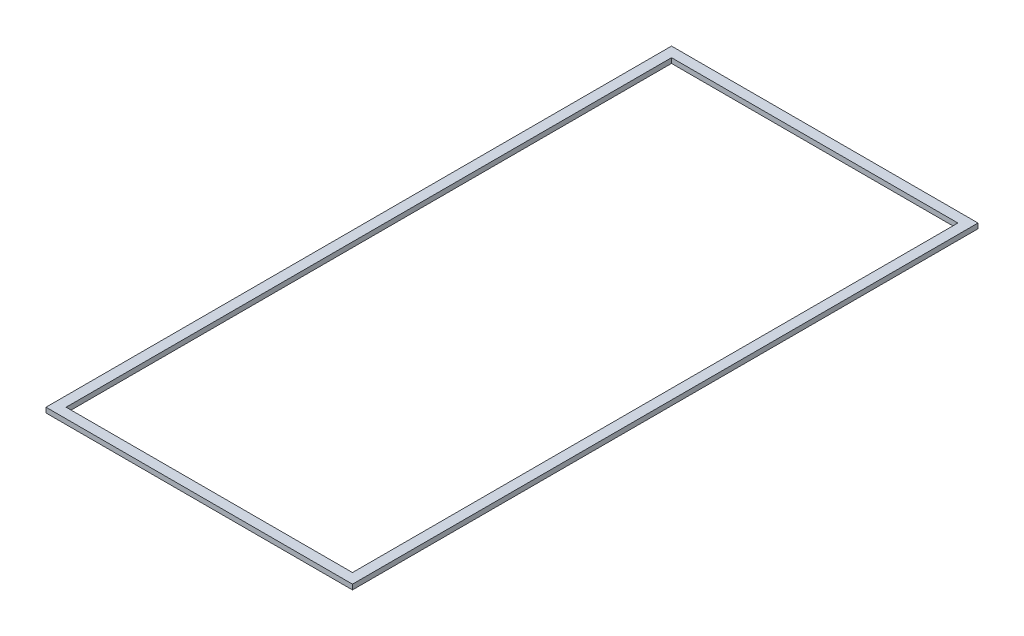
ISO-10303-21;
HEADER;
FILE_DESCRIPTION(('STEP AP214'),'2;1');
FILE_NAME('part.step','',(''),(''),'','','');
FILE_SCHEMA(('AUTOMOTIVE_DESIGN { 1 0 10303 214 1 1 1 1 }'));
ENDSEC;
DATA;
#1=APPLICATION_CONTEXT('core data for automotive mechanical design processes');
#2=APPLICATION_PROTOCOL_DEFINITION('international standard','automotive_design',2000,#1);
#3=PRODUCT_CONTEXT('',#1,'mechanical');
#4=PRODUCT('Part','Part','',(#3));
#5=PRODUCT_RELATED_PRODUCT_CATEGORY('part','',(#4));
#6=PRODUCT_DEFINITION_FORMATION('','',#4);
#7=PRODUCT_DEFINITION_CONTEXT('part definition',#1,'design');
#8=PRODUCT_DEFINITION('design','',#6,#7);
#9=PRODUCT_DEFINITION_SHAPE('','',#8);
#10=(LENGTH_UNIT() NAMED_UNIT(*) SI_UNIT(.MILLI.,.METRE.));
#11=(NAMED_UNIT(*) PLANE_ANGLE_UNIT() SI_UNIT($,.RADIAN.));
#12=(NAMED_UNIT(*) SI_UNIT($,.STERADIAN.) SOLID_ANGLE_UNIT());
#13=UNCERTAINTY_MEASURE_WITH_UNIT(LENGTH_MEASURE(1.E-05),#10,'distance_accuracy_value','');
#14=(GEOMETRIC_REPRESENTATION_CONTEXT(3) GLOBAL_UNCERTAINTY_ASSIGNED_CONTEXT((#13)) GLOBAL_UNIT_ASSIGNED_CONTEXT((#10,
#11,#12)) REPRESENTATION_CONTEXT('',''));
#15=CARTESIAN_POINT('',(0.,0.,0.));
#16=DIRECTION('',(0.,0.,1.));
#17=DIRECTION('',(1.,0.,0.));
#18=AXIS2_PLACEMENT_3D('',#15,#16,#17);
#19=CARTESIAN_POINT('',(0.,10.,0.));
#20=DIRECTION('',(0.,1.,0.));
#21=DIRECTION('',(0.,0.,1.));
#22=AXIS2_PLACEMENT_3D('',#19,#20,#21);
#23=PLANE('',#22);
#24=DIRECTION('',(0.,0.,1.));
#25=VECTOR('',#24,1.);
#26=CARTESIAN_POINT('',(0.,10.,0.));
#27=LINE('',#26,#25);
#28=CARTESIAN_POINT('',(0.,10.,-1245.));
#29=VERTEX_POINT('',#28);
#30=CARTESIAN_POINT('',(0.,10.,0.));
#31=VERTEX_POINT('',#30);
#32=EDGE_CURVE('E177',#29,#31,#27,.T.);
#33=ORIENTED_EDGE('',*,*,#32,.T.);
#34=DIRECTION('',(1.,0.,0.));
#35=VECTOR('',#34,1.);
#36=CARTESIAN_POINT('',(0.,10.,0.));
#37=LINE('',#36,#35);
#38=CARTESIAN_POINT('',(610.,10.,0.));
#39=VERTEX_POINT('',#38);
#40=EDGE_CURVE('E181',#31,#39,#37,.T.);
#41=ORIENTED_EDGE('',*,*,#40,.T.);
#42=DIRECTION('',(0.,0.,-1.));
#43=VECTOR('',#42,1.);
#44=CARTESIAN_POINT('',(610.,10.,0.));
#45=LINE('',#44,#43);
#46=CARTESIAN_POINT('',(610.,10.,-1245.));
#47=VERTEX_POINT('',#46);
#48=EDGE_CURVE('E185',#39,#47,#45,.T.);
#49=ORIENTED_EDGE('',*,*,#48,.T.);
#50=DIRECTION('',(-1.,0.,0.));
#51=VECTOR('',#50,1.);
#52=CARTESIAN_POINT('',(0.,10.,-1245.));
#53=LINE('',#52,#51);
#54=EDGE_CURVE('E188',#47,#29,#53,.T.);
#55=ORIENTED_EDGE('',*,*,#54,.T.);
#56=EDGE_LOOP('',(#33,#41,#49,#55));
#57=FACE_BOUND('',#56,.T.);
#58=DIRECTION('',(1.,0.,0.));
#59=VECTOR('',#58,1.);
#60=CARTESIAN_POINT('',(0.,10.,-20.));
#61=LINE('',#60,#59);
#62=CARTESIAN_POINT('',(20.,10.,-20.));
#63=VERTEX_POINT('',#62);
#64=CARTESIAN_POINT('',(590.,10.,-20.));
#65=VERTEX_POINT('',#64);
#66=EDGE_CURVE('E138',#63,#65,#61,.T.);
#67=ORIENTED_EDGE('',*,*,#66,.F.);
#68=DIRECTION('',(0.,0.,1.));
#69=VECTOR('',#68,1.);
#70=CARTESIAN_POINT('',(20.,10.,0.));
#71=LINE('',#70,#69);
#72=CARTESIAN_POINT('',(20.,10.,-1225.));
#73=VERTEX_POINT('',#72);
#74=EDGE_CURVE('E129',#73,#63,#71,.T.);
#75=ORIENTED_EDGE('',*,*,#74,.F.);
#76=DIRECTION('',(-1.,0.,0.));
#77=VECTOR('',#76,1.);
#78=CARTESIAN_POINT('',(0.,10.,-1225.));
#79=LINE('',#78,#77);
#80=CARTESIAN_POINT('',(590.,10.,-1225.));
#81=VERTEX_POINT('',#80);
#82=EDGE_CURVE('E155',#81,#73,#79,.T.);
#83=ORIENTED_EDGE('',*,*,#82,.F.);
#84=DIRECTION('',(0.,0.,-1.));
#85=VECTOR('',#84,1.);
#86=CARTESIAN_POINT('',(590.,10.,0.));
#87=LINE('',#86,#85);
#88=EDGE_CURVE('E151',#65,#81,#87,.T.);
#89=ORIENTED_EDGE('',*,*,#88,.F.);
#90=EDGE_LOOP('',(#67,#75,#83,#89));
#91=FACE_BOUND('',#90,.T.);
#92=ADVANCED_FACE('F63',(#57,#91),#23,.T.);
#93=CARTESIAN_POINT('',(0.,0.,0.));
#94=DIRECTION('',(0.,1.,0.));
#95=DIRECTION('',(0.,0.,1.));
#96=AXIS2_PLACEMENT_3D('',#93,#94,#95);
#97=PLANE('',#96);
#98=DIRECTION('',(0.,0.,1.));
#99=VECTOR('',#98,1.);
#100=CARTESIAN_POINT('',(0.,0.,0.));
#101=LINE('',#100,#99);
#102=CARTESIAN_POINT('',(0.,0.,-1245.));
#103=VERTEX_POINT('',#102);
#104=CARTESIAN_POINT('',(0.,0.,0.));
#105=VERTEX_POINT('',#104);
#106=EDGE_CURVE('E147',#103,#105,#101,.T.);
#107=ORIENTED_EDGE('',*,*,#106,.F.);
#108=DIRECTION('',(-1.,0.,0.));
#109=VECTOR('',#108,1.);
#110=CARTESIAN_POINT('',(0.,0.,-1245.));
#111=LINE('',#110,#109);
#112=CARTESIAN_POINT('',(610.,0.,-1245.));
#113=VERTEX_POINT('',#112);
#114=EDGE_CURVE('E182',#113,#103,#111,.T.);
#115=ORIENTED_EDGE('',*,*,#114,.F.);
#116=DIRECTION('',(0.,0.,-1.));
#117=VECTOR('',#116,1.);
#118=CARTESIAN_POINT('',(610.,0.,0.));
#119=LINE('',#118,#117);
#120=CARTESIAN_POINT('',(610.,0.,0.));
#121=VERTEX_POINT('',#120);
#122=EDGE_CURVE('E198',#121,#113,#119,.T.);
#123=ORIENTED_EDGE('',*,*,#122,.F.);
#124=DIRECTION('',(1.,0.,0.));
#125=VECTOR('',#124,1.);
#126=CARTESIAN_POINT('',(0.,0.,0.));
#127=LINE('',#126,#125);
#128=EDGE_CURVE('E195',#105,#121,#127,.T.);
#129=ORIENTED_EDGE('',*,*,#128,.F.);
#130=EDGE_LOOP('',(#107,#115,#123,#129));
#131=FACE_BOUND('',#130,.T.);
#132=DIRECTION('',(0.,0.,1.));
#133=VECTOR('',#132,1.);
#134=CARTESIAN_POINT('',(20.,0.,0.));
#135=LINE('',#134,#133);
#136=CARTESIAN_POINT('',(20.,0.,-1225.));
#137=VERTEX_POINT('',#136);
#138=CARTESIAN_POINT('',(20.,0.,-20.));
#139=VERTEX_POINT('',#138);
#140=EDGE_CURVE('E87',#137,#139,#135,.T.);
#141=ORIENTED_EDGE('',*,*,#140,.T.);
#142=DIRECTION('',(1.,0.,0.));
#143=VECTOR('',#142,1.);
#144=CARTESIAN_POINT('',(0.,0.,-20.));
#145=LINE('',#144,#143);
#146=CARTESIAN_POINT('',(590.,0.,-20.));
#147=VERTEX_POINT('',#146);
#148=EDGE_CURVE('E145',#139,#147,#145,.T.);
#149=ORIENTED_EDGE('',*,*,#148,.T.);
#150=DIRECTION('',(0.,0.,-1.));
#151=VECTOR('',#150,1.);
#152=CARTESIAN_POINT('',(590.,0.,0.));
#153=LINE('',#152,#151);
#154=CARTESIAN_POINT('',(590.,0.,-1225.));
#155=VERTEX_POINT('',#154);
#156=EDGE_CURVE('E164',#147,#155,#153,.T.);
#157=ORIENTED_EDGE('',*,*,#156,.T.);
#158=DIRECTION('',(-1.,0.,0.));
#159=VECTOR('',#158,1.);
#160=CARTESIAN_POINT('',(0.,0.,-1225.));
#161=LINE('',#160,#159);
#162=EDGE_CURVE('E139',#155,#137,#161,.T.);
#163=ORIENTED_EDGE('',*,*,#162,.T.);
#164=EDGE_LOOP('',(#141,#149,#157,#163));
#165=FACE_BOUND('',#164,.T.);
#166=ADVANCED_FACE('F221',(#131,#165),#97,.F.);
#167=CARTESIAN_POINT('',(0.,10.,0.));
#168=DIRECTION('',(1.,0.,0.));
#169=DIRECTION('',(0.,0.,-1.));
#170=AXIS2_PLACEMENT_3D('',#167,#168,#169);
#171=PLANE('',#170);
#172=ORIENTED_EDGE('',*,*,#106,.T.);
#173=DIRECTION('',(0.,-1.,0.));
#174=VECTOR('',#173,1.);
#175=CARTESIAN_POINT('',(0.,10.,0.));
#176=LINE('',#175,#174);
#177=EDGE_CURVE('E12',#31,#105,#176,.T.);
#178=ORIENTED_EDGE('',*,*,#177,.F.);
#179=ORIENTED_EDGE('',*,*,#32,.F.);
#180=DIRECTION('',(0.,-1.,0.));
#181=VECTOR('',#180,1.);
#182=CARTESIAN_POINT('',(0.,10.,-1245.));
#183=LINE('',#182,#181);
#184=EDGE_CURVE('E191',#29,#103,#183,.T.);
#185=ORIENTED_EDGE('',*,*,#184,.T.);
#186=EDGE_LOOP('',(#172,#178,#179,#185));
#187=FACE_BOUND('',#186,.T.);
#188=ADVANCED_FACE('F65',(#187),#171,.F.);
#189=CARTESIAN_POINT('',(0.,10.,0.));
#190=DIRECTION('',(0.,0.,-1.));
#191=DIRECTION('',(-1.,0.,0.));
#192=AXIS2_PLACEMENT_3D('',#189,#190,#191);
#193=PLANE('',#192);
#194=ORIENTED_EDGE('',*,*,#128,.T.);
#195=DIRECTION('',(0.,-1.,0.));
#196=VECTOR('',#195,1.);
#197=CARTESIAN_POINT('',(610.,10.,0.));
#198=LINE('',#197,#196);
#199=EDGE_CURVE('E72',#39,#121,#198,.T.);
#200=ORIENTED_EDGE('',*,*,#199,.F.);
#201=ORIENTED_EDGE('',*,*,#40,.F.);
#202=ORIENTED_EDGE('',*,*,#177,.T.);
#203=EDGE_LOOP('',(#194,#200,#201,#202));
#204=FACE_BOUND('',#203,.T.);
#205=ADVANCED_FACE('F231',(#204),#193,.F.);
#206=CARTESIAN_POINT('',(610.,10.,0.));
#207=DIRECTION('',(-1.,0.,0.));
#208=DIRECTION('',(0.,0.,1.));
#209=AXIS2_PLACEMENT_3D('',#206,#207,#208);
#210=PLANE('',#209);
#211=ORIENTED_EDGE('',*,*,#122,.T.);
#212=DIRECTION('',(0.,-1.,0.));
#213=VECTOR('',#212,1.);
#214=CARTESIAN_POINT('',(610.,10.,-1245.));
#215=LINE('',#214,#213);
#216=EDGE_CURVE('E206',#47,#113,#215,.T.);
#217=ORIENTED_EDGE('',*,*,#216,.F.);
#218=ORIENTED_EDGE('',*,*,#48,.F.);
#219=ORIENTED_EDGE('',*,*,#199,.T.);
#220=EDGE_LOOP('',(#211,#217,#218,#219));
#221=FACE_BOUND('',#220,.T.);
#222=ADVANCED_FACE('F215',(#221),#210,.F.);
#223=CARTESIAN_POINT('',(0.,10.,-1245.));
#224=DIRECTION('',(0.,0.,1.));
#225=DIRECTION('',(1.,0.,0.));
#226=AXIS2_PLACEMENT_3D('',#223,#224,#225);
#227=PLANE('',#226);
#228=ORIENTED_EDGE('',*,*,#114,.T.);
#229=ORIENTED_EDGE('',*,*,#184,.F.);
#230=ORIENTED_EDGE('',*,*,#54,.F.);
#231=ORIENTED_EDGE('',*,*,#216,.T.);
#232=EDGE_LOOP('',(#228,#229,#230,#231));
#233=FACE_BOUND('',#232,.T.);
#234=ADVANCED_FACE('F225',(#233),#227,.F.);
#235=CARTESIAN_POINT('',(20.,10.,0.));
#236=DIRECTION('',(1.,0.,0.));
#237=DIRECTION('',(0.,0.,-1.));
#238=AXIS2_PLACEMENT_3D('',#235,#236,#237);
#239=PLANE('',#238);
#240=ORIENTED_EDGE('',*,*,#140,.F.);
#241=DIRECTION('',(0.,-1.,0.));
#242=VECTOR('',#241,1.);
#243=CARTESIAN_POINT('',(20.,10.,-1225.));
#244=LINE('',#243,#242);
#245=EDGE_CURVE('E133',#73,#137,#244,.T.);
#246=ORIENTED_EDGE('',*,*,#245,.F.);
#247=ORIENTED_EDGE('',*,*,#74,.T.);
#248=DIRECTION('',(0.,-1.,0.));
#249=VECTOR('',#248,1.);
#250=CARTESIAN_POINT('',(20.,10.,-20.));
#251=LINE('',#250,#249);
#252=EDGE_CURVE('E132',#63,#139,#251,.T.);
#253=ORIENTED_EDGE('',*,*,#252,.T.);
#254=EDGE_LOOP('',(#240,#246,#247,#253));
#255=FACE_BOUND('',#254,.T.);
#256=ADVANCED_FACE('F131',(#255),#239,.T.);
#257=CARTESIAN_POINT('',(0.,10.,-20.));
#258=DIRECTION('',(0.,0.,-1.));
#259=DIRECTION('',(-1.,0.,0.));
#260=AXIS2_PLACEMENT_3D('',#257,#258,#259);
#261=PLANE('',#260);
#262=ORIENTED_EDGE('',*,*,#148,.F.);
#263=ORIENTED_EDGE('',*,*,#252,.F.);
#264=ORIENTED_EDGE('',*,*,#66,.T.);
#265=DIRECTION('',(0.,-1.,0.));
#266=VECTOR('',#265,1.);
#267=CARTESIAN_POINT('',(590.,10.,-20.));
#268=LINE('',#267,#266);
#269=EDGE_CURVE('E148',#65,#147,#268,.T.);
#270=ORIENTED_EDGE('',*,*,#269,.T.);
#271=EDGE_LOOP('',(#262,#263,#264,#270));
#272=FACE_BOUND('',#271,.T.);
#273=ADVANCED_FACE('F142',(#272),#261,.T.);
#274=CARTESIAN_POINT('',(590.,10.,0.));
#275=DIRECTION('',(-1.,0.,0.));
#276=DIRECTION('',(0.,0.,1.));
#277=AXIS2_PLACEMENT_3D('',#274,#275,#276);
#278=PLANE('',#277);
#279=ORIENTED_EDGE('',*,*,#156,.F.);
#280=ORIENTED_EDGE('',*,*,#269,.F.);
#281=ORIENTED_EDGE('',*,*,#88,.T.);
#282=DIRECTION('',(0.,-1.,0.));
#283=VECTOR('',#282,1.);
#284=CARTESIAN_POINT('',(590.,10.,-1225.));
#285=LINE('',#284,#283);
#286=EDGE_CURVE('E79',#81,#155,#285,.T.);
#287=ORIENTED_EDGE('',*,*,#286,.T.);
#288=EDGE_LOOP('',(#279,#280,#281,#287));
#289=FACE_BOUND('',#288,.T.);
#290=ADVANCED_FACE('F254',(#289),#278,.T.);
#291=CARTESIAN_POINT('',(0.,10.,-1225.));
#292=DIRECTION('',(0.,0.,1.));
#293=DIRECTION('',(1.,0.,0.));
#294=AXIS2_PLACEMENT_3D('',#291,#292,#293);
#295=PLANE('',#294);
#296=ORIENTED_EDGE('',*,*,#162,.F.);
#297=ORIENTED_EDGE('',*,*,#286,.F.);
#298=ORIENTED_EDGE('',*,*,#82,.T.);
#299=ORIENTED_EDGE('',*,*,#245,.T.);
#300=EDGE_LOOP('',(#296,#297,#298,#299));
#301=FACE_BOUND('',#300,.T.);
#302=ADVANCED_FACE('F258',(#301),#295,.T.);
#303=CLOSED_SHELL('',(#92,#166,#188,#205,#222,#234,#256,#273,#290,#302));
#304=MANIFOLD_SOLID_BREP('B2',#303);
#305=ADVANCED_BREP_SHAPE_REPRESENTATION('',(#18,#304),#14);
#306=SHAPE_DEFINITION_REPRESENTATION(#9,#305);
ENDSEC;
END-ISO-10303-21;
